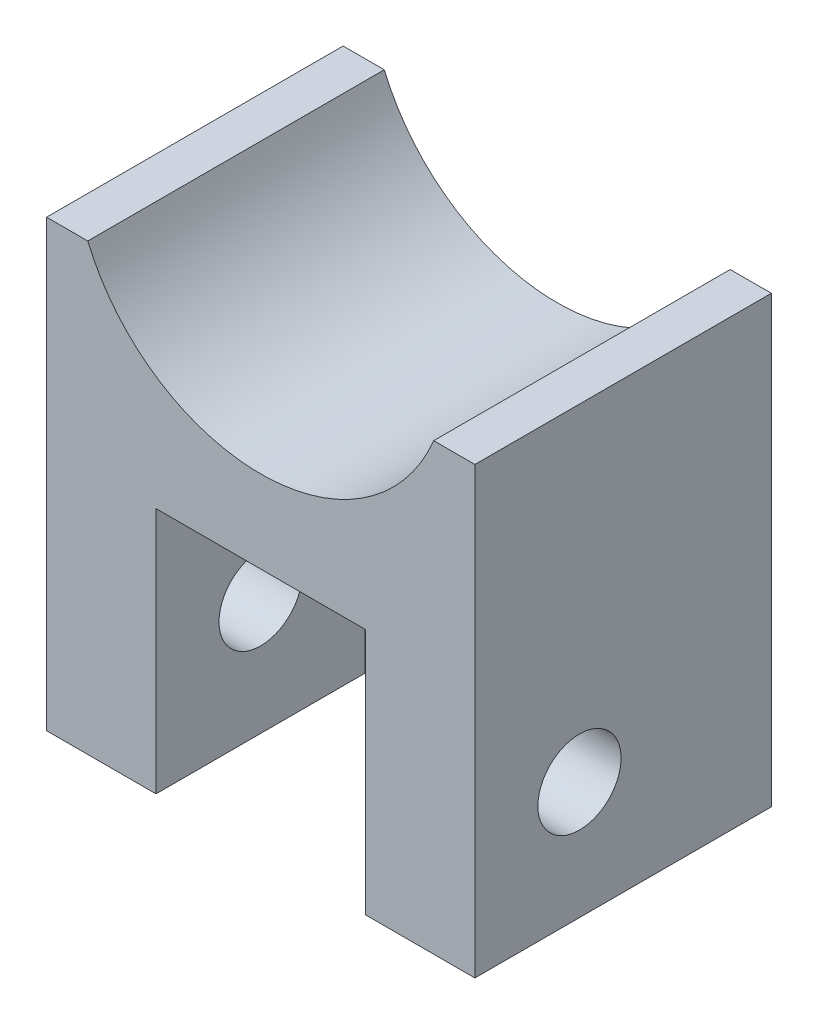
ISO-10303-21;
HEADER;
FILE_DESCRIPTION(('STEP AP214'),'2;1');
FILE_NAME('part.step','',(''),(''),'','','');
FILE_SCHEMA(('AUTOMOTIVE_DESIGN { 1 0 10303 214 1 1 1 1 }'));
ENDSEC;
DATA;
#1=APPLICATION_CONTEXT('core data for automotive mechanical design processes');
#2=APPLICATION_PROTOCOL_DEFINITION('international standard','automotive_design',2000,#1);
#3=PRODUCT_CONTEXT('',#1,'mechanical');
#4=PRODUCT('Part','Part','',(#3));
#5=PRODUCT_RELATED_PRODUCT_CATEGORY('part','',(#4));
#6=PRODUCT_DEFINITION_FORMATION('','',#4);
#7=PRODUCT_DEFINITION_CONTEXT('part definition',#1,'design');
#8=PRODUCT_DEFINITION('design','',#6,#7);
#9=PRODUCT_DEFINITION_SHAPE('','',#8);
#10=(LENGTH_UNIT() NAMED_UNIT(*) SI_UNIT(.MILLI.,.METRE.));
#11=(NAMED_UNIT(*) PLANE_ANGLE_UNIT() SI_UNIT($,.RADIAN.));
#12=(NAMED_UNIT(*) SI_UNIT($,.STERADIAN.) SOLID_ANGLE_UNIT());
#13=UNCERTAINTY_MEASURE_WITH_UNIT(LENGTH_MEASURE(1.E-05),#10,'distance_accuracy_value','');
#14=(GEOMETRIC_REPRESENTATION_CONTEXT(3) GLOBAL_UNCERTAINTY_ASSIGNED_CONTEXT((#13)) GLOBAL_UNIT_ASSIGNED_CONTEXT((#10,
#11,#12)) REPRESENTATION_CONTEXT('',''));
#15=CARTESIAN_POINT('',(0.,0.,0.));
#16=DIRECTION('',(0.,0.,1.));
#17=DIRECTION('',(1.,0.,0.));
#18=AXIS2_PLACEMENT_3D('',#15,#16,#17);
#19=CARTESIAN_POINT('',(0.,0.,18.));
#20=DIRECTION('',(1.,0.,0.));
#21=DIRECTION('',(0.,0.,-1.));
#22=AXIS2_PLACEMENT_3D('',#19,#20,#21);
#23=PLANE('',#22);
#24=CARTESIAN_POINT('',(0.,7.13,11.65));
#25=DIRECTION('',(-1.,0.,0.));
#26=DIRECTION('',(0.,0.,1.));
#27=AXIS2_PLACEMENT_3D('',#24,#25,#26);
#28=CIRCLE('',#27,2.525);
#29=CARTESIAN_POINT('',(0.,7.13,14.175));
#30=VERTEX_POINT('',#29);
#31=EDGE_CURVE('E265',#30,#30,#28,.T.);
#32=ORIENTED_EDGE('',*,*,#31,.F.);
#33=EDGE_LOOP('',(#32));
#34=FACE_BOUND('',#33,.T.);
#35=DIRECTION('',(0.,-1.,0.));
#36=VECTOR('',#35,1.);
#37=CARTESIAN_POINT('',(0.,0.,0.));
#38=LINE('',#37,#36);
#39=CARTESIAN_POINT('',(0.,27.,0.));
#40=VERTEX_POINT('',#39);
#41=CARTESIAN_POINT('',(0.,0.,0.));
#42=VERTEX_POINT('',#41);
#43=EDGE_CURVE('E131',#40,#42,#38,.T.);
#44=ORIENTED_EDGE('',*,*,#43,.T.);
#45=DIRECTION('',(0.,0.,-1.));
#46=VECTOR('',#45,1.);
#47=CARTESIAN_POINT('',(0.,0.,18.));
#48=LINE('',#47,#46);
#49=CARTESIAN_POINT('',(0.,0.,18.));
#50=VERTEX_POINT('',#49);
#51=EDGE_CURVE('E11',#50,#42,#48,.T.);
#52=ORIENTED_EDGE('',*,*,#51,.F.);
#53=DIRECTION('',(0.,-1.,0.));
#54=VECTOR('',#53,1.);
#55=CARTESIAN_POINT('',(0.,0.,18.));
#56=LINE('',#55,#54);
#57=CARTESIAN_POINT('',(0.,27.,18.));
#58=VERTEX_POINT('',#57);
#59=EDGE_CURVE('E143',#58,#50,#56,.T.);
#60=ORIENTED_EDGE('',*,*,#59,.F.);
#61=DIRECTION('',(0.,0.,-1.));
#62=VECTOR('',#61,1.);
#63=CARTESIAN_POINT('',(0.,27.,18.));
#64=LINE('',#63,#62);
#65=EDGE_CURVE('E127',#58,#40,#64,.T.);
#66=ORIENTED_EDGE('',*,*,#65,.T.);
#67=EDGE_LOOP('',(#44,#52,#60,#66));
#68=FACE_BOUND('',#67,.T.);
#69=ADVANCED_FACE('F33',(#34,#68),#23,.F.);
#70=CARTESIAN_POINT('',(0.,0.,18.));
#71=DIRECTION('',(0.,1.,0.));
#72=DIRECTION('',(0.,0.,1.));
#73=AXIS2_PLACEMENT_3D('',#70,#71,#72);
#74=PLANE('',#73);
#75=DIRECTION('',(1.,0.,0.));
#76=VECTOR('',#75,1.);
#77=CARTESIAN_POINT('',(0.,0.,18.));
#78=LINE('',#77,#76);
#79=CARTESIAN_POINT('',(19.36,0.,18.));
#80=VERTEX_POINT('',#79);
#81=CARTESIAN_POINT('',(26.,0.,18.));
#82=VERTEX_POINT('',#81);
#83=EDGE_CURVE('E160',#80,#82,#78,.T.);
#84=ORIENTED_EDGE('',*,*,#83,.F.);
#85=DIRECTION('',(0.,0.,1.));
#86=VECTOR('',#85,1.);
#87=CARTESIAN_POINT('',(19.36,0.,5.3));
#88=LINE('',#87,#86);
#89=CARTESIAN_POINT('',(19.36,0.,5.3));
#90=VERTEX_POINT('',#89);
#91=EDGE_CURVE('E135',#90,#80,#88,.T.);
#92=ORIENTED_EDGE('',*,*,#91,.F.);
#93=DIRECTION('',(1.,0.,0.));
#94=VECTOR('',#93,1.);
#95=CARTESIAN_POINT('',(6.64,0.,5.3));
#96=LINE('',#95,#94);
#97=CARTESIAN_POINT('',(6.64,0.,5.3));
#98=VERTEX_POINT('',#97);
#99=EDGE_CURVE('E193',#98,#90,#96,.T.);
#100=ORIENTED_EDGE('',*,*,#99,.F.);
#101=DIRECTION('',(0.,0.,1.));
#102=VECTOR('',#101,1.);
#103=CARTESIAN_POINT('',(6.64,0.,5.3));
#104=LINE('',#103,#102);
#105=CARTESIAN_POINT('',(6.64,0.,18.));
#106=VERTEX_POINT('',#105);
#107=EDGE_CURVE('E217',#98,#106,#104,.T.);
#108=ORIENTED_EDGE('',*,*,#107,.T.);
#109=EDGE_CURVE('E92',#50,#106,#78,.T.);
#110=ORIENTED_EDGE('',*,*,#109,.F.);
#111=ORIENTED_EDGE('',*,*,#51,.T.);
#112=DIRECTION('',(1.,0.,0.));
#113=VECTOR('',#112,1.);
#114=CARTESIAN_POINT('',(0.,0.,0.));
#115=LINE('',#114,#113);
#116=CARTESIAN_POINT('',(26.,0.,0.));
#117=VERTEX_POINT('',#116);
#118=EDGE_CURVE('E134',#42,#117,#115,.T.);
#119=ORIENTED_EDGE('',*,*,#118,.T.);
#120=DIRECTION('',(0.,0.,-1.));
#121=VECTOR('',#120,1.);
#122=CARTESIAN_POINT('',(26.,0.,18.));
#123=LINE('',#122,#121);
#124=EDGE_CURVE('E41',#82,#117,#123,.T.);
#125=ORIENTED_EDGE('',*,*,#124,.F.);
#126=EDGE_LOOP('',(#84,#92,#100,#108,#110,#111,#119,#125));
#127=FACE_BOUND('',#126,.T.);
#128=ADVANCED_FACE('F219',(#127),#74,.F.);
#129=CARTESIAN_POINT('',(26.,0.,18.));
#130=DIRECTION('',(-1.,0.,0.));
#131=DIRECTION('',(0.,-1.,0.));
#132=AXIS2_PLACEMENT_3D('',#129,#130,#131);
#133=PLANE('',#132);
#134=CARTESIAN_POINT('',(26.,7.13,11.65));
#135=DIRECTION('',(-1.,0.,0.));
#136=DIRECTION('',(0.,0.,1.));
#137=AXIS2_PLACEMENT_3D('',#134,#135,#136);
#138=CIRCLE('',#137,2.525);
#139=CARTESIAN_POINT('',(26.,7.13,14.175));
#140=VERTEX_POINT('',#139);
#141=EDGE_CURVE('E260',#140,#140,#138,.T.);
#142=ORIENTED_EDGE('',*,*,#141,.T.);
#143=EDGE_LOOP('',(#142));
#144=FACE_BOUND('',#143,.T.);
#145=DIRECTION('',(0.,1.,0.));
#146=VECTOR('',#145,1.);
#147=CARTESIAN_POINT('',(26.,0.,0.));
#148=LINE('',#147,#146);
#149=CARTESIAN_POINT('',(26.,27.,0.));
#150=VERTEX_POINT('',#149);
#151=EDGE_CURVE('E137',#117,#150,#148,.T.);
#152=ORIENTED_EDGE('',*,*,#151,.T.);
#153=DIRECTION('',(0.,0.,-1.));
#154=VECTOR('',#153,1.);
#155=CARTESIAN_POINT('',(26.,27.,18.));
#156=LINE('',#155,#154);
#157=CARTESIAN_POINT('',(26.,27.,18.));
#158=VERTEX_POINT('',#157);
#159=EDGE_CURVE('E122',#158,#150,#156,.T.);
#160=ORIENTED_EDGE('',*,*,#159,.F.);
#161=DIRECTION('',(0.,1.,0.));
#162=VECTOR('',#161,1.);
#163=CARTESIAN_POINT('',(26.,0.,18.));
#164=LINE('',#163,#162);
#165=EDGE_CURVE('E110',#82,#158,#164,.T.);
#166=ORIENTED_EDGE('',*,*,#165,.F.);
#167=ORIENTED_EDGE('',*,*,#124,.T.);
#168=EDGE_LOOP('',(#152,#160,#166,#167));
#169=FACE_BOUND('',#168,.T.);
#170=ADVANCED_FACE('F151',(#144,#169),#133,.F.);
#171=CARTESIAN_POINT('',(26.,27.,18.));
#172=DIRECTION('',(0.,-1.,0.));
#173=DIRECTION('',(0.,0.,-1.));
#174=AXIS2_PLACEMENT_3D('',#171,#172,#173);
#175=PLANE('',#174);
#176=DIRECTION('',(-1.,0.,0.));
#177=VECTOR('',#176,1.);
#178=CARTESIAN_POINT('',(26.,27.,0.));
#179=LINE('',#178,#177);
#180=CARTESIAN_POINT('',(23.5,27.,0.));
#181=VERTEX_POINT('',#180);
#182=EDGE_CURVE('E119',#150,#181,#179,.T.);
#183=ORIENTED_EDGE('',*,*,#182,.T.);
#184=DIRECTION('',(0.,0.,-1.));
#185=VECTOR('',#184,1.);
#186=CARTESIAN_POINT('',(23.5,27.,18.));
#187=LINE('',#186,#185);
#188=CARTESIAN_POINT('',(23.5,27.,18.));
#189=VERTEX_POINT('',#188);
#190=EDGE_CURVE('E116',#189,#181,#187,.T.);
#191=ORIENTED_EDGE('',*,*,#190,.F.);
#192=DIRECTION('',(-1.,0.,0.));
#193=VECTOR('',#192,1.);
#194=CARTESIAN_POINT('',(26.,27.,18.));
#195=LINE('',#194,#193);
#196=EDGE_CURVE('E103',#158,#189,#195,.T.);
#197=ORIENTED_EDGE('',*,*,#196,.F.);
#198=ORIENTED_EDGE('',*,*,#159,.T.);
#199=EDGE_LOOP('',(#183,#191,#197,#198));
#200=FACE_BOUND('',#199,.T.);
#201=ADVANCED_FACE('F117',(#200),#175,.F.);
#202=CARTESIAN_POINT('',(13.,31.375,18.));
#203=DIRECTION('',(0.,0.,-1.));
#204=DIRECTION('',(-1.,0.,0.));
#205=AXIS2_PLACEMENT_3D('',#202,#203,#204);
#206=CYLINDRICAL_SURFACE('',#205,11.375);
#207=CARTESIAN_POINT('',(13.,31.375,0.));
#208=DIRECTION('',(0.,0.,-1.));
#209=DIRECTION('',(1.,0.,0.));
#210=AXIS2_PLACEMENT_3D('',#207,#208,#209);
#211=CIRCLE('',#210,11.375);
#212=CARTESIAN_POINT('',(2.5,27.,0.));
#213=VERTEX_POINT('',#212);
#214=EDGE_CURVE('E140',#181,#213,#211,.T.);
#215=ORIENTED_EDGE('',*,*,#214,.T.);
#216=DIRECTION('',(0.,0.,-1.));
#217=VECTOR('',#216,1.);
#218=CARTESIAN_POINT('',(2.5,27.,18.));
#219=LINE('',#218,#217);
#220=CARTESIAN_POINT('',(2.5,27.,18.));
#221=VERTEX_POINT('',#220);
#222=EDGE_CURVE('E123',#221,#213,#219,.T.);
#223=ORIENTED_EDGE('',*,*,#222,.F.);
#224=CARTESIAN_POINT('',(13.,31.375,18.));
#225=DIRECTION('',(0.,0.,-1.));
#226=DIRECTION('',(1.,0.,0.));
#227=AXIS2_PLACEMENT_3D('',#224,#225,#226);
#228=CIRCLE('',#227,11.375);
#229=EDGE_CURVE('E107',#189,#221,#228,.T.);
#230=ORIENTED_EDGE('',*,*,#229,.F.);
#231=ORIENTED_EDGE('',*,*,#190,.T.);
#232=EDGE_LOOP('',(#215,#223,#230,#231));
#233=FACE_BOUND('',#232,.T.);
#234=ADVANCED_FACE('F125',(#233),#206,.F.);
#235=CARTESIAN_POINT('',(0.,27.,18.));
#236=DIRECTION('',(0.,-1.,0.));
#237=DIRECTION('',(0.,0.,-1.));
#238=AXIS2_PLACEMENT_3D('',#235,#236,#237);
#239=PLANE('',#238);
#240=DIRECTION('',(-1.,0.,0.));
#241=VECTOR('',#240,1.);
#242=CARTESIAN_POINT('',(0.,27.,0.));
#243=LINE('',#242,#241);
#244=EDGE_CURVE('E84',#213,#40,#243,.T.);
#245=ORIENTED_EDGE('',*,*,#244,.T.);
#246=ORIENTED_EDGE('',*,*,#65,.F.);
#247=DIRECTION('',(-1.,0.,0.));
#248=VECTOR('',#247,1.);
#249=CARTESIAN_POINT('',(0.,27.,18.));
#250=LINE('',#249,#248);
#251=EDGE_CURVE('E57',#221,#58,#250,.T.);
#252=ORIENTED_EDGE('',*,*,#251,.F.);
#253=ORIENTED_EDGE('',*,*,#222,.T.);
#254=EDGE_LOOP('',(#245,#246,#252,#253));
#255=FACE_BOUND('',#254,.T.);
#256=ADVANCED_FACE('F156',(#255),#239,.F.);
#257=CARTESIAN_POINT('',(13.,31.375,18.));
#258=DIRECTION('',(0.,0.,1.));
#259=DIRECTION('',(1.,0.,0.));
#260=AXIS2_PLACEMENT_3D('',#257,#258,#259);
#261=PLANE('',#260);
#262=DIRECTION('',(0.,1.,0.));
#263=VECTOR('',#262,1.);
#264=CARTESIAN_POINT('',(19.36,15.,18.));
#265=LINE('',#264,#263);
#266=CARTESIAN_POINT('',(19.36,15.,18.));
#267=VERTEX_POINT('',#266);
#268=EDGE_CURVE('E48',#80,#267,#265,.T.);
#269=ORIENTED_EDGE('',*,*,#268,.F.);
#270=ORIENTED_EDGE('',*,*,#83,.T.);
#271=ORIENTED_EDGE('',*,*,#165,.T.);
#272=ORIENTED_EDGE('',*,*,#196,.T.);
#273=ORIENTED_EDGE('',*,*,#229,.T.);
#274=ORIENTED_EDGE('',*,*,#251,.T.);
#275=ORIENTED_EDGE('',*,*,#59,.T.);
#276=ORIENTED_EDGE('',*,*,#109,.T.);
#277=DIRECTION('',(0.,-1.,0.));
#278=VECTOR('',#277,1.);
#279=CARTESIAN_POINT('',(6.64,15.,18.));
#280=LINE('',#279,#278);
#281=CARTESIAN_POINT('',(6.64,15.,18.));
#282=VERTEX_POINT('',#281);
#283=EDGE_CURVE('E171',#282,#106,#280,.T.);
#284=ORIENTED_EDGE('',*,*,#283,.F.);
#285=DIRECTION('',(-1.,0.,0.));
#286=VECTOR('',#285,1.);
#287=CARTESIAN_POINT('',(6.64,15.,18.));
#288=LINE('',#287,#286);
#289=EDGE_CURVE('E206',#267,#282,#288,.T.);
#290=ORIENTED_EDGE('',*,*,#289,.F.);
#291=EDGE_LOOP('',(#269,#270,#271,#272,#273,#274,#275,#276,#284,#290));
#292=FACE_BOUND('',#291,.T.);
#293=ADVANCED_FACE('F105',(#292),#261,.T.);
#294=CARTESIAN_POINT('',(13.,31.375,0.));
#295=DIRECTION('',(0.,0.,1.));
#296=DIRECTION('',(1.,0.,0.));
#297=AXIS2_PLACEMENT_3D('',#294,#295,#296);
#298=PLANE('',#297);
#299=ORIENTED_EDGE('',*,*,#43,.F.);
#300=ORIENTED_EDGE('',*,*,#244,.F.);
#301=ORIENTED_EDGE('',*,*,#214,.F.);
#302=ORIENTED_EDGE('',*,*,#182,.F.);
#303=ORIENTED_EDGE('',*,*,#151,.F.);
#304=ORIENTED_EDGE('',*,*,#118,.F.);
#305=EDGE_LOOP('',(#299,#300,#301,#302,#303,#304));
#306=FACE_BOUND('',#305,.T.);
#307=ADVANCED_FACE('F155',(#306),#298,.F.);
#308=CARTESIAN_POINT('',(19.36,15.,5.3));
#309=DIRECTION('',(1.,0.,0.));
#310=DIRECTION('',(0.,1.,0.));
#311=AXIS2_PLACEMENT_3D('',#308,#309,#310);
#312=PLANE('',#311);
#313=CARTESIAN_POINT('',(19.36,7.13,11.65));
#314=DIRECTION('',(1.,0.,0.));
#315=DIRECTION('',(0.,1.,0.));
#316=AXIS2_PLACEMENT_3D('',#313,#314,#315);
#317=CIRCLE('',#316,2.525);
#318=CARTESIAN_POINT('',(19.36,9.655,11.65));
#319=VERTEX_POINT('',#318);
#320=EDGE_CURVE('E209',#319,#319,#317,.T.);
#321=ORIENTED_EDGE('',*,*,#320,.T.);
#322=EDGE_LOOP('',(#321));
#323=FACE_BOUND('',#322,.T.);
#324=ORIENTED_EDGE('',*,*,#268,.T.);
#325=DIRECTION('',(0.,0.,1.));
#326=VECTOR('',#325,1.);
#327=CARTESIAN_POINT('',(19.36,15.,5.3));
#328=LINE('',#327,#326);
#329=CARTESIAN_POINT('',(19.36,15.,5.3));
#330=VERTEX_POINT('',#329);
#331=EDGE_CURVE('E164',#330,#267,#328,.T.);
#332=ORIENTED_EDGE('',*,*,#331,.F.);
#333=DIRECTION('',(0.,1.,0.));
#334=VECTOR('',#333,1.);
#335=CARTESIAN_POINT('',(19.36,15.,5.3));
#336=LINE('',#335,#334);
#337=EDGE_CURVE('E188',#90,#330,#336,.T.);
#338=ORIENTED_EDGE('',*,*,#337,.F.);
#339=ORIENTED_EDGE('',*,*,#91,.T.);
#340=EDGE_LOOP('',(#324,#332,#338,#339));
#341=FACE_BOUND('',#340,.T.);
#342=ADVANCED_FACE('F186',(#323,#341),#312,.F.);
#343=CARTESIAN_POINT('',(6.64,15.,5.3));
#344=DIRECTION('',(-1.,0.,0.));
#345=DIRECTION('',(0.,-1.,0.));
#346=AXIS2_PLACEMENT_3D('',#343,#344,#345);
#347=PLANE('',#346);
#348=CARTESIAN_POINT('',(6.64,7.13,11.65));
#349=DIRECTION('',(-1.,0.,0.));
#350=DIRECTION('',(0.,-1.,0.));
#351=AXIS2_PLACEMENT_3D('',#348,#349,#350);
#352=CIRCLE('',#351,2.525);
#353=CARTESIAN_POINT('',(6.64,4.605,11.65));
#354=VERTEX_POINT('',#353);
#355=EDGE_CURVE('E36',#354,#354,#352,.T.);
#356=ORIENTED_EDGE('',*,*,#355,.T.);
#357=EDGE_LOOP('',(#356));
#358=FACE_BOUND('',#357,.T.);
#359=ORIENTED_EDGE('',*,*,#283,.T.);
#360=ORIENTED_EDGE('',*,*,#107,.F.);
#361=DIRECTION('',(0.,-1.,0.));
#362=VECTOR('',#361,1.);
#363=CARTESIAN_POINT('',(6.64,15.,5.3));
#364=LINE('',#363,#362);
#365=CARTESIAN_POINT('',(6.64,15.,5.3));
#366=VERTEX_POINT('',#365);
#367=EDGE_CURVE('E200',#366,#98,#364,.T.);
#368=ORIENTED_EDGE('',*,*,#367,.F.);
#369=DIRECTION('',(0.,0.,1.));
#370=VECTOR('',#369,1.);
#371=CARTESIAN_POINT('',(6.64,15.,5.3));
#372=LINE('',#371,#370);
#373=EDGE_CURVE('E192',#366,#282,#372,.T.);
#374=ORIENTED_EDGE('',*,*,#373,.T.);
#375=EDGE_LOOP('',(#359,#360,#368,#374));
#376=FACE_BOUND('',#375,.T.);
#377=ADVANCED_FACE('F218',(#358,#376),#347,.F.);
#378=CARTESIAN_POINT('',(6.64,15.,5.3));
#379=DIRECTION('',(0.,1.,0.));
#380=DIRECTION('',(0.,0.,1.));
#381=AXIS2_PLACEMENT_3D('',#378,#379,#380);
#382=PLANE('',#381);
#383=ORIENTED_EDGE('',*,*,#289,.T.);
#384=ORIENTED_EDGE('',*,*,#373,.F.);
#385=DIRECTION('',(-1.,0.,0.));
#386=VECTOR('',#385,1.);
#387=CARTESIAN_POINT('',(6.64,15.,5.3));
#388=LINE('',#387,#386);
#389=EDGE_CURVE('E195',#330,#366,#388,.T.);
#390=ORIENTED_EDGE('',*,*,#389,.F.);
#391=ORIENTED_EDGE('',*,*,#331,.T.);
#392=EDGE_LOOP('',(#383,#384,#390,#391));
#393=FACE_BOUND('',#392,.T.);
#394=ADVANCED_FACE('F196',(#393),#382,.F.);
#395=CARTESIAN_POINT('',(0.,0.,5.3));
#396=DIRECTION('',(0.,0.,1.));
#397=DIRECTION('',(1.,0.,0.));
#398=AXIS2_PLACEMENT_3D('',#395,#396,#397);
#399=PLANE('',#398);
#400=ORIENTED_EDGE('',*,*,#337,.T.);
#401=ORIENTED_EDGE('',*,*,#389,.T.);
#402=ORIENTED_EDGE('',*,*,#367,.T.);
#403=ORIENTED_EDGE('',*,*,#99,.T.);
#404=EDGE_LOOP('',(#400,#401,#402,#403));
#405=FACE_BOUND('',#404,.T.);
#406=ADVANCED_FACE('F202',(#405),#399,.T.);
#407=CARTESIAN_POINT('',(26.,7.13,11.65));
#408=DIRECTION('',(-1.,0.,0.));
#409=DIRECTION('',(0.,0.,1.));
#410=AXIS2_PLACEMENT_3D('',#407,#408,#409);
#411=CYLINDRICAL_SURFACE('',#410,2.525);
#412=ORIENTED_EDGE('',*,*,#31,.T.);
#413=EDGE_LOOP('',(#412));
#414=FACE_BOUND('',#413,.T.);
#415=ORIENTED_EDGE('',*,*,#355,.F.);
#416=EDGE_LOOP('',(#415));
#417=FACE_BOUND('',#416,.T.);
#418=ADVANCED_FACE('F249',(#414,#417),#411,.F.);
#419=ORIENTED_EDGE('',*,*,#141,.F.);
#420=EDGE_LOOP('',(#419));
#421=FACE_BOUND('',#420,.T.);
#422=ORIENTED_EDGE('',*,*,#320,.F.);
#423=EDGE_LOOP('',(#422));
#424=FACE_BOUND('',#423,.T.);
#425=ADVANCED_FACE('F250',(#421,#424),#411,.F.);
#426=CLOSED_SHELL('',(#69,#128,#170,#201,#234,#256,#293,#307,#342,#377,#394,#406,#418,#425));
#427=MANIFOLD_SOLID_BREP('B2',#426);
#428=ADVANCED_BREP_SHAPE_REPRESENTATION('',(#18,#427),#14);
#429=SHAPE_DEFINITION_REPRESENTATION(#9,#428);
ENDSEC;
END-ISO-10303-21;
